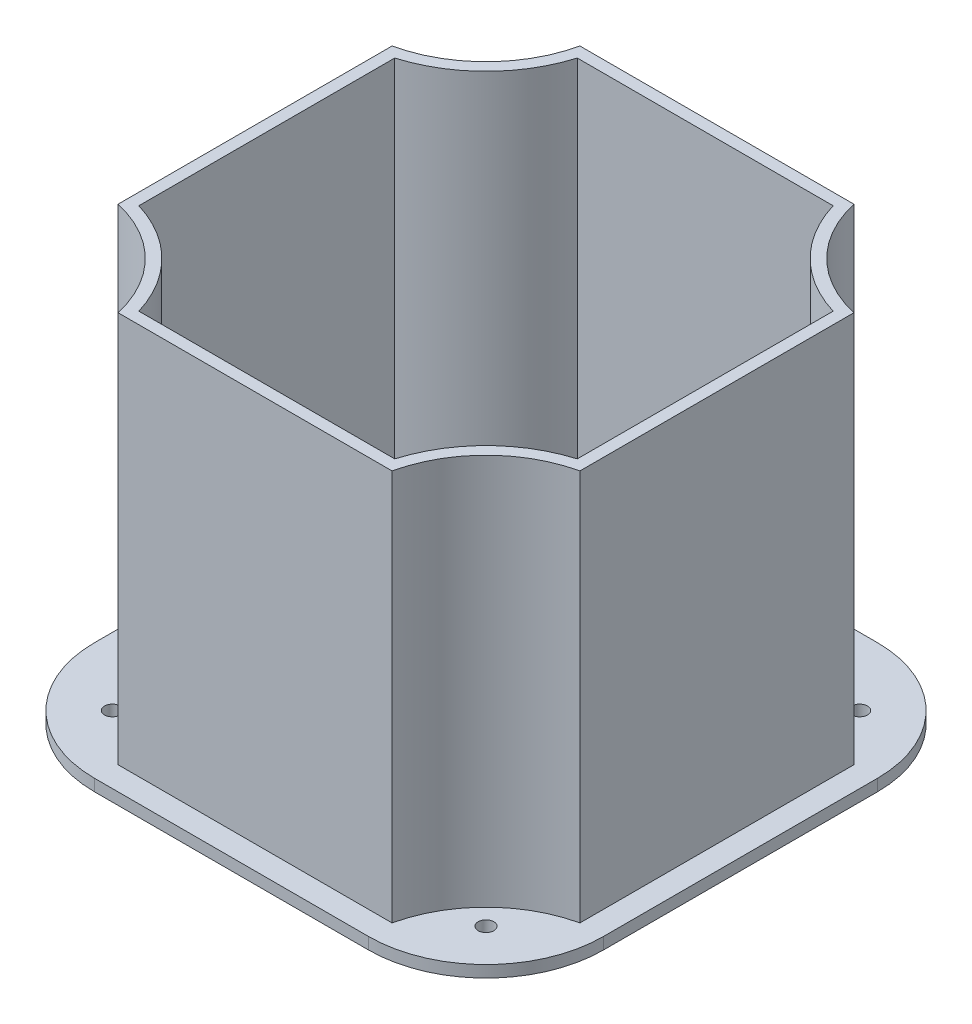
ISO-10303-21;
HEADER;
FILE_DESCRIPTION(('STEP AP214'),'2;1');
FILE_NAME('part.step','',(''),(''),'','','');
FILE_SCHEMA(('AUTOMOTIVE_DESIGN { 1 0 10303 214 1 1 1 1 }'));
ENDSEC;
DATA;
#1=APPLICATION_CONTEXT('core data for automotive mechanical design processes');
#2=APPLICATION_PROTOCOL_DEFINITION('international standard','automotive_design',2000,#1);
#3=PRODUCT_CONTEXT('',#1,'mechanical');
#4=PRODUCT('Part','Part','',(#3));
#5=PRODUCT_RELATED_PRODUCT_CATEGORY('part','',(#4));
#6=PRODUCT_DEFINITION_FORMATION('','',#4);
#7=PRODUCT_DEFINITION_CONTEXT('part definition',#1,'design');
#8=PRODUCT_DEFINITION('design','',#6,#7);
#9=PRODUCT_DEFINITION_SHAPE('','',#8);
#10=(LENGTH_UNIT() NAMED_UNIT(*) SI_UNIT(.MILLI.,.METRE.));
#11=(NAMED_UNIT(*) PLANE_ANGLE_UNIT() SI_UNIT($,.RADIAN.));
#12=(NAMED_UNIT(*) SI_UNIT($,.STERADIAN.) SOLID_ANGLE_UNIT());
#13=UNCERTAINTY_MEASURE_WITH_UNIT(LENGTH_MEASURE(1.E-05),#10,'distance_accuracy_value','');
#14=(GEOMETRIC_REPRESENTATION_CONTEXT(3) GLOBAL_UNCERTAINTY_ASSIGNED_CONTEXT((#13)) GLOBAL_UNIT_ASSIGNED_CONTEXT((#10,
#11,#12)) REPRESENTATION_CONTEXT('',''));
#15=CARTESIAN_POINT('',(0.,0.,0.));
#16=DIRECTION('',(0.,0.,1.));
#17=DIRECTION('',(1.,0.,0.));
#18=AXIS2_PLACEMENT_3D('',#15,#16,#17);
#19=CARTESIAN_POINT('',(18.535245878062,1.5,16.1689695853489));
#20=DIRECTION('',(0.,1.,0.));
#21=DIRECTION('',(0.,0.,1.));
#22=AXIS2_PLACEMENT_3D('',#19,#20,#21);
#23=PLANE('',#22);
#24=CARTESIAN_POINT('',(-22.8287151526167,1.5,-25.1949914453303));
#25=DIRECTION('',(0.,1.,0.));
#26=DIRECTION('',(0.,0.,1.));
#27=AXIS2_PLACEMENT_3D('',#24,#25,#26);
#28=CIRCLE('',#27,1.);
#29=CARTESIAN_POINT('',(-22.8287151526167,1.5,-24.1949914453303));
#30=VERTEX_POINT('',#29);
#31=EDGE_CURVE('E228',#30,#30,#28,.T.);
#32=ORIENTED_EDGE('',*,*,#31,.F.);
#33=EDGE_LOOP('',(#32));
#34=FACE_BOUND('',#33,.T.);
#35=CARTESIAN_POINT('',(24.8992069087408,1.5,22.5329306160279));
#36=DIRECTION('',(0.,1.,0.));
#37=DIRECTION('',(0.,0.,1.));
#38=AXIS2_PLACEMENT_3D('',#35,#36,#37);
#39=CIRCLE('',#38,1.);
#40=CARTESIAN_POINT('',(24.8992069087408,1.5,23.5329306160279));
#41=VERTEX_POINT('',#40);
#42=EDGE_CURVE('E218',#41,#41,#39,.T.);
#43=ORIENTED_EDGE('',*,*,#42,.F.);
#44=EDGE_LOOP('',(#43));
#45=FACE_BOUND('',#44,.T.);
#46=CARTESIAN_POINT('',(18.535245878062,1.5,16.1689695853489));
#47=DIRECTION('',(0.,1.,0.));
#48=DIRECTION('',(0.,0.,1.));
#49=AXIS2_PLACEMENT_3D('',#46,#47,#48);
#50=CIRCLE('',#49,15.);
#51=CARTESIAN_POINT('',(18.5352458780619,1.5,31.1689695853489));
#52=VERTEX_POINT('',#51);
#53=CARTESIAN_POINT('',(33.535245878062,1.5,16.1689695853488));
#54=VERTEX_POINT('',#53);
#55=EDGE_CURVE('E163',#52,#54,#50,.T.);
#56=ORIENTED_EDGE('',*,*,#55,.T.);
#57=DIRECTION('',(0.,0.,-1.));
#58=VECTOR('',#57,1.);
#59=CARTESIAN_POINT('',(33.535245878062,1.5,16.1689695853488));
#60=LINE('',#59,#58);
#61=CARTESIAN_POINT('',(33.535245878062,1.5,-18.831030414651));
#62=VERTEX_POINT('',#61);
#63=EDGE_CURVE('E106',#54,#62,#60,.T.);
#64=ORIENTED_EDGE('',*,*,#63,.T.);
#65=CARTESIAN_POINT('',(18.535245878062,1.5,-18.8310304146511));
#66=DIRECTION('',(0.,1.,0.));
#67=DIRECTION('',(0.,0.,1.));
#68=AXIS2_PLACEMENT_3D('',#65,#66,#67);
#69=CIRCLE('',#68,15.);
#70=CARTESIAN_POINT('',(18.5352458780619,1.5,-33.8310304146511));
#71=VERTEX_POINT('',#70);
#72=EDGE_CURVE('E178',#62,#71,#69,.T.);
#73=ORIENTED_EDGE('',*,*,#72,.T.);
#74=DIRECTION('',(-1.,0.,0.));
#75=VECTOR('',#74,1.);
#76=CARTESIAN_POINT('',(18.5352458780619,1.5,-33.8310304146511));
#77=LINE('',#76,#75);
#78=CARTESIAN_POINT('',(-16.4647541219379,1.5,-33.8310304146511));
#79=VERTEX_POINT('',#78);
#80=EDGE_CURVE('E191',#71,#79,#77,.T.);
#81=ORIENTED_EDGE('',*,*,#80,.T.);
#82=CARTESIAN_POINT('',(-16.464754121938,1.5,-18.8310304146511));
#83=DIRECTION('',(0.,1.,0.));
#84=DIRECTION('',(0.,0.,1.));
#85=AXIS2_PLACEMENT_3D('',#82,#83,#84);
#86=CIRCLE('',#85,15.);
#87=CARTESIAN_POINT('',(-31.464754121938,1.5,-18.831030414651));
#88=VERTEX_POINT('',#87);
#89=EDGE_CURVE('E127',#79,#88,#86,.T.);
#90=ORIENTED_EDGE('',*,*,#89,.T.);
#91=DIRECTION('',(0.,0.,1.));
#92=VECTOR('',#91,1.);
#93=CARTESIAN_POINT('',(-31.464754121938,1.5,-18.831030414651));
#94=LINE('',#93,#92);
#95=CARTESIAN_POINT('',(-31.464754121938,1.5,16.1689695853488));
#96=VERTEX_POINT('',#95);
#97=EDGE_CURVE('E121',#88,#96,#94,.T.);
#98=ORIENTED_EDGE('',*,*,#97,.T.);
#99=CARTESIAN_POINT('',(-16.464754121938,1.5,16.1689695853489));
#100=DIRECTION('',(0.,1.,0.));
#101=DIRECTION('',(0.,0.,1.));
#102=AXIS2_PLACEMENT_3D('',#99,#100,#101);
#103=CIRCLE('',#102,15.);
#104=CARTESIAN_POINT('',(-16.4647541219379,1.5,31.1689695853489));
#105=VERTEX_POINT('',#104);
#106=EDGE_CURVE('E124',#96,#105,#103,.T.);
#107=ORIENTED_EDGE('',*,*,#106,.T.);
#108=DIRECTION('',(1.,0.,0.));
#109=VECTOR('',#108,1.);
#110=CARTESIAN_POINT('',(-16.4647541219379,1.5,31.1689695853489));
#111=LINE('',#110,#109);
#112=EDGE_CURVE('E65',#105,#52,#111,.T.);
#113=ORIENTED_EDGE('',*,*,#112,.T.);
#114=EDGE_LOOP('',(#56,#64,#73,#81,#90,#98,#107,#113));
#115=FACE_BOUND('',#114,.T.);
#116=DIRECTION('',(0.,0.,-1.));
#117=VECTOR('',#116,1.);
#118=CARTESIAN_POINT('',(30.5352458780619,1.5,16.1689695853489));
#119=LINE('',#118,#117);
#120=CARTESIAN_POINT('',(30.5352458780619,1.5,16.1689695853489));
#121=VERTEX_POINT('',#120);
#122=CARTESIAN_POINT('',(30.535245878062,1.5,-18.831030414651));
#123=VERTEX_POINT('',#122);
#124=EDGE_CURVE('E212',#121,#123,#119,.T.);
#125=ORIENTED_EDGE('',*,*,#124,.F.);
#126=CARTESIAN_POINT('',(34.0017247818063,1.5,31.6354484890935));
#127=DIRECTION('',(0.,-1.,0.));
#128=DIRECTION('',(0.,0.,1.));
#129=AXIS2_PLACEMENT_3D('',#126,#127,#128);
#130=CIRCLE('',#129,15.8501875594606);
#131=CARTESIAN_POINT('',(18.5352458780619,1.5,28.1689695853489));
#132=VERTEX_POINT('',#131);
#133=EDGE_CURVE('E215',#132,#121,#130,.T.);
#134=ORIENTED_EDGE('',*,*,#133,.F.);
#135=DIRECTION('',(1.,0.,0.));
#136=VECTOR('',#135,1.);
#137=CARTESIAN_POINT('',(18.5352458780619,1.5,28.1689695853489));
#138=LINE('',#137,#136);
#139=CARTESIAN_POINT('',(-16.4647541219379,1.5,28.1689695853489));
#140=VERTEX_POINT('',#139);
#141=EDGE_CURVE('E56',#140,#132,#138,.T.);
#142=ORIENTED_EDGE('',*,*,#141,.F.);
#143=CARTESIAN_POINT('',(-31.9312330256827,1.5,31.6354484890931));
#144=DIRECTION('',(0.,-1.,0.));
#145=DIRECTION('',(0.,0.,1.));
#146=AXIS2_PLACEMENT_3D('',#143,#144,#145);
#147=CIRCLE('',#146,15.8501875594606);
#148=CARTESIAN_POINT('',(-28.464754121938,1.5,16.1689695853486));
#149=VERTEX_POINT('',#148);
#150=EDGE_CURVE('E198',#149,#140,#147,.T.);
#151=ORIENTED_EDGE('',*,*,#150,.F.);
#152=DIRECTION('',(0.,0.,1.));
#153=VECTOR('',#152,1.);
#154=CARTESIAN_POINT('',(-28.4647541219379,1.5,-18.8310304146514));
#155=LINE('',#154,#153);
#156=CARTESIAN_POINT('',(-28.4647541219379,1.5,-18.8310304146514));
#157=VERTEX_POINT('',#156);
#158=EDGE_CURVE('E200',#157,#149,#155,.T.);
#159=ORIENTED_EDGE('',*,*,#158,.F.);
#160=CARTESIAN_POINT('',(-31.9312330256821,1.5,-34.297509318396));
#161=DIRECTION('',(0.,-1.,0.));
#162=DIRECTION('',(0.,0.,1.));
#163=AXIS2_PLACEMENT_3D('',#160,#161,#162);
#164=CIRCLE('',#163,15.8501875594605);
#165=CARTESIAN_POINT('',(-16.4647541219378,1.5,-30.8310304146511));
#166=VERTEX_POINT('',#165);
#167=EDGE_CURVE('E203',#166,#157,#164,.T.);
#168=ORIENTED_EDGE('',*,*,#167,.F.);
#169=DIRECTION('',(-1.,0.,0.));
#170=VECTOR('',#169,1.);
#171=CARTESIAN_POINT('',(-16.4647541219379,1.5,-30.8310304146511));
#172=LINE('',#171,#170);
#173=CARTESIAN_POINT('',(18.5352458780619,1.5,-30.8310304146511));
#174=VERTEX_POINT('',#173);
#175=EDGE_CURVE('E206',#174,#166,#172,.T.);
#176=ORIENTED_EDGE('',*,*,#175,.F.);
#177=CARTESIAN_POINT('',(34.0017247818065,1.5,-34.2975093183955));
#178=DIRECTION('',(0.,-1.,0.));
#179=DIRECTION('',(0.,0.,1.));
#180=AXIS2_PLACEMENT_3D('',#177,#178,#179);
#181=CIRCLE('',#180,15.8501875594606);
#182=EDGE_CURVE('E209',#123,#174,#181,.T.);
#183=ORIENTED_EDGE('',*,*,#182,.F.);
#184=EDGE_LOOP('',(#125,#134,#142,#151,#159,#168,#176,#183));
#185=FACE_BOUND('',#184,.T.);
#186=CARTESIAN_POINT('',(-22.8287151526171,1.5,22.5329306160277));
#187=DIRECTION('',(0.,1.,0.));
#188=DIRECTION('',(0.,0.,1.));
#189=AXIS2_PLACEMENT_3D('',#186,#187,#188);
#190=CIRCLE('',#189,1.00000000000001);
#191=CARTESIAN_POINT('',(-22.8287151526171,1.5,23.5329306160277));
#192=VERTEX_POINT('',#191);
#193=EDGE_CURVE('E222',#192,#192,#190,.T.);
#194=ORIENTED_EDGE('',*,*,#193,.F.);
#195=EDGE_LOOP('',(#194));
#196=FACE_BOUND('',#195,.T.);
#197=CARTESIAN_POINT('',(24.8992069087409,1.5,-25.1949914453301));
#198=DIRECTION('',(0.,1.,0.));
#199=DIRECTION('',(0.,0.,1.));
#200=AXIS2_PLACEMENT_3D('',#197,#198,#199);
#201=CIRCLE('',#200,1.);
#202=CARTESIAN_POINT('',(24.8992069087409,1.5,-24.1949914453301));
#203=VERTEX_POINT('',#202);
#204=EDGE_CURVE('E234',#203,#203,#201,.T.);
#205=ORIENTED_EDGE('',*,*,#204,.F.);
#206=EDGE_LOOP('',(#205));
#207=FACE_BOUND('',#206,.T.);
#208=ADVANCED_FACE('F41',(#34,#45,#115,#185,#196,#207),#23,.T.);
#209=CARTESIAN_POINT('',(18.535245878062,0.,16.1689695853489));
#210=DIRECTION('',(0.,1.,0.));
#211=DIRECTION('',(0.,0.,1.));
#212=AXIS2_PLACEMENT_3D('',#209,#210,#211);
#213=PLANE('',#212);
#214=CARTESIAN_POINT('',(18.535245878062,0.,16.1689695853489));
#215=DIRECTION('',(0.,1.,0.));
#216=DIRECTION('',(0.,0.,1.));
#217=AXIS2_PLACEMENT_3D('',#214,#215,#216);
#218=CIRCLE('',#217,15.);
#219=CARTESIAN_POINT('',(18.5352458780619,0.,31.1689695853489));
#220=VERTEX_POINT('',#219);
#221=CARTESIAN_POINT('',(33.535245878062,0.,16.1689695853488));
#222=VERTEX_POINT('',#221);
#223=EDGE_CURVE('E148',#220,#222,#218,.T.);
#224=ORIENTED_EDGE('',*,*,#223,.F.);
#225=DIRECTION('',(1.,0.,0.));
#226=VECTOR('',#225,1.);
#227=CARTESIAN_POINT('',(-16.4647541219379,0.,31.1689695853489));
#228=LINE('',#227,#226);
#229=CARTESIAN_POINT('',(-16.4647541219379,0.,31.1689695853489));
#230=VERTEX_POINT('',#229);
#231=EDGE_CURVE('E98',#230,#220,#228,.T.);
#232=ORIENTED_EDGE('',*,*,#231,.F.);
#233=CARTESIAN_POINT('',(-16.464754121938,0.,16.1689695853489));
#234=DIRECTION('',(0.,1.,0.));
#235=DIRECTION('',(0.,0.,1.));
#236=AXIS2_PLACEMENT_3D('',#233,#234,#235);
#237=CIRCLE('',#236,15.);
#238=CARTESIAN_POINT('',(-31.464754121938,0.,16.1689695853488));
#239=VERTEX_POINT('',#238);
#240=EDGE_CURVE('E160',#239,#230,#237,.T.);
#241=ORIENTED_EDGE('',*,*,#240,.F.);
#242=DIRECTION('',(0.,0.,1.));
#243=VECTOR('',#242,1.);
#244=CARTESIAN_POINT('',(-31.464754121938,0.,-18.831030414651));
#245=LINE('',#244,#243);
#246=CARTESIAN_POINT('',(-31.464754121938,0.,-18.831030414651));
#247=VERTEX_POINT('',#246);
#248=EDGE_CURVE('E136',#247,#239,#245,.T.);
#249=ORIENTED_EDGE('',*,*,#248,.F.);
#250=CARTESIAN_POINT('',(-16.464754121938,0.,-18.8310304146511));
#251=DIRECTION('',(0.,1.,0.));
#252=DIRECTION('',(0.,0.,1.));
#253=AXIS2_PLACEMENT_3D('',#250,#251,#252);
#254=CIRCLE('',#253,15.);
#255=CARTESIAN_POINT('',(-16.4647541219379,0.,-33.8310304146511));
#256=VERTEX_POINT('',#255);
#257=EDGE_CURVE('E157',#256,#247,#254,.T.);
#258=ORIENTED_EDGE('',*,*,#257,.F.);
#259=DIRECTION('',(-1.,0.,0.));
#260=VECTOR('',#259,1.);
#261=CARTESIAN_POINT('',(18.5352458780619,0.,-33.8310304146511));
#262=LINE('',#261,#260);
#263=CARTESIAN_POINT('',(18.5352458780619,0.,-33.8310304146511));
#264=VERTEX_POINT('',#263);
#265=EDGE_CURVE('E155',#264,#256,#262,.T.);
#266=ORIENTED_EDGE('',*,*,#265,.F.);
#267=CARTESIAN_POINT('',(18.535245878062,0.,-18.8310304146511));
#268=DIRECTION('',(0.,1.,0.));
#269=DIRECTION('',(0.,0.,1.));
#270=AXIS2_PLACEMENT_3D('',#267,#268,#269);
#271=CIRCLE('',#270,15.);
#272=CARTESIAN_POINT('',(33.535245878062,0.,-18.831030414651));
#273=VERTEX_POINT('',#272);
#274=EDGE_CURVE('E153',#273,#264,#271,.T.);
#275=ORIENTED_EDGE('',*,*,#274,.F.);
#276=DIRECTION('',(0.,0.,-1.));
#277=VECTOR('',#276,1.);
#278=CARTESIAN_POINT('',(33.535245878062,0.,16.1689695853488));
#279=LINE('',#278,#277);
#280=EDGE_CURVE('E151',#222,#273,#279,.T.);
#281=ORIENTED_EDGE('',*,*,#280,.F.);
#282=EDGE_LOOP('',(#224,#232,#241,#249,#258,#266,#275,#281));
#283=FACE_BOUND('',#282,.T.);
#284=CARTESIAN_POINT('',(24.8992069087408,0.,22.5329306160279));
#285=DIRECTION('',(0.,1.,0.));
#286=DIRECTION('',(0.,0.,1.));
#287=AXIS2_PLACEMENT_3D('',#284,#285,#286);
#288=CIRCLE('',#287,1.);
#289=CARTESIAN_POINT('',(24.8992069087408,0.,23.5329306160279));
#290=VERTEX_POINT('',#289);
#291=EDGE_CURVE('E219',#290,#290,#288,.T.);
#292=ORIENTED_EDGE('',*,*,#291,.T.);
#293=EDGE_LOOP('',(#292));
#294=FACE_BOUND('',#293,.T.);
#295=CARTESIAN_POINT('',(-22.8287151526171,0.,22.5329306160277));
#296=DIRECTION('',(0.,1.,0.));
#297=DIRECTION('',(0.,0.,1.));
#298=AXIS2_PLACEMENT_3D('',#295,#296,#297);
#299=CIRCLE('',#298,1.00000000000001);
#300=CARTESIAN_POINT('',(-22.8287151526171,0.,23.5329306160277));
#301=VERTEX_POINT('',#300);
#302=EDGE_CURVE('E225',#301,#301,#299,.T.);
#303=ORIENTED_EDGE('',*,*,#302,.T.);
#304=EDGE_LOOP('',(#303));
#305=FACE_BOUND('',#304,.T.);
#306=CARTESIAN_POINT('',(-22.8287151526167,0.,-25.1949914453303));
#307=DIRECTION('',(0.,1.,0.));
#308=DIRECTION('',(0.,0.,1.));
#309=AXIS2_PLACEMENT_3D('',#306,#307,#308);
#310=CIRCLE('',#309,1.);
#311=CARTESIAN_POINT('',(-22.8287151526167,0.,-24.1949914453303));
#312=VERTEX_POINT('',#311);
#313=EDGE_CURVE('E231',#312,#312,#310,.T.);
#314=ORIENTED_EDGE('',*,*,#313,.T.);
#315=EDGE_LOOP('',(#314));
#316=FACE_BOUND('',#315,.T.);
#317=CARTESIAN_POINT('',(24.8992069087409,0.,-25.1949914453301));
#318=DIRECTION('',(0.,1.,0.));
#319=DIRECTION('',(0.,0.,1.));
#320=AXIS2_PLACEMENT_3D('',#317,#318,#319);
#321=CIRCLE('',#320,1.);
#322=CARTESIAN_POINT('',(24.8992069087409,0.,-24.1949914453301));
#323=VERTEX_POINT('',#322);
#324=EDGE_CURVE('E237',#323,#323,#321,.T.);
#325=ORIENTED_EDGE('',*,*,#324,.T.);
#326=EDGE_LOOP('',(#325));
#327=FACE_BOUND('',#326,.T.);
#328=DIRECTION('',(0.,0.,1.));
#329=VECTOR('',#328,1.);
#330=CARTESIAN_POINT('',(29.0352458780619,0.,15.0112764601735));
#331=LINE('',#330,#329);
#332=CARTESIAN_POINT('',(29.035245878062,0.,-17.6733372894756));
#333=VERTEX_POINT('',#332);
#334=CARTESIAN_POINT('',(29.0352458780619,0.,15.0112764601735));
#335=VERTEX_POINT('',#334);
#336=EDGE_CURVE('E339',#333,#335,#331,.T.);
#337=ORIENTED_EDGE('',*,*,#336,.F.);
#338=CARTESIAN_POINT('',(34.0017247818065,0.,-34.2975093183955));
#339=DIRECTION('',(0.,1.,0.));
#340=DIRECTION('',(0.,0.,1.));
#341=AXIS2_PLACEMENT_3D('',#338,#339,#340);
#342=CIRCLE('',#341,17.3501875594607);
#343=CARTESIAN_POINT('',(17.3775527528865,0.,-29.3310304146511));
#344=VERTEX_POINT('',#343);
#345=EDGE_CURVE('E338',#344,#333,#342,.T.);
#346=ORIENTED_EDGE('',*,*,#345,.F.);
#347=DIRECTION('',(1.,0.,0.));
#348=VECTOR('',#347,1.);
#349=CARTESIAN_POINT('',(17.3775527528865,0.,-29.3310304146511));
#350=LINE('',#349,#348);
#351=CARTESIAN_POINT('',(-15.3070609967623,0.,-29.3310304146511));
#352=VERTEX_POINT('',#351);
#353=EDGE_CURVE('E357',#352,#344,#350,.T.);
#354=ORIENTED_EDGE('',*,*,#353,.F.);
#355=CARTESIAN_POINT('',(-31.9312330256821,0.,-34.297509318396));
#356=DIRECTION('',(0.,1.,0.));
#357=DIRECTION('',(0.,0.,1.));
#358=AXIS2_PLACEMENT_3D('',#355,#356,#357);
#359=CIRCLE('',#358,17.3501875594606);
#360=CARTESIAN_POINT('',(-26.9647541219379,0.,-17.673337289476));
#361=VERTEX_POINT('',#360);
#362=EDGE_CURVE('E354',#361,#352,#359,.T.);
#363=ORIENTED_EDGE('',*,*,#362,.F.);
#364=DIRECTION('',(0.,0.,-1.));
#365=VECTOR('',#364,1.);
#366=CARTESIAN_POINT('',(-26.9647541219379,0.,-17.673337289476));
#367=LINE('',#366,#365);
#368=CARTESIAN_POINT('',(-26.964754121938,0.,15.0112764601731));
#369=VERTEX_POINT('',#368);
#370=EDGE_CURVE('E351',#369,#361,#367,.T.);
#371=ORIENTED_EDGE('',*,*,#370,.F.);
#372=CARTESIAN_POINT('',(-31.9312330256827,0.,31.6354484890931));
#373=DIRECTION('',(0.,1.,0.));
#374=DIRECTION('',(0.,0.,1.));
#375=AXIS2_PLACEMENT_3D('',#372,#373,#374);
#376=CIRCLE('',#375,17.3501875594608);
#377=CARTESIAN_POINT('',(-15.3070609967626,0.,26.6689695853489));
#378=VERTEX_POINT('',#377);
#379=EDGE_CURVE('E348',#378,#369,#376,.T.);
#380=ORIENTED_EDGE('',*,*,#379,.F.);
#381=DIRECTION('',(-1.,0.,0.));
#382=VECTOR('',#381,1.);
#383=CARTESIAN_POINT('',(-15.3070609967626,0.,26.6689695853489));
#384=LINE('',#383,#382);
#385=CARTESIAN_POINT('',(17.3775527528864,0.,26.6689695853489));
#386=VERTEX_POINT('',#385);
#387=EDGE_CURVE('E345',#386,#378,#384,.T.);
#388=ORIENTED_EDGE('',*,*,#387,.F.);
#389=CARTESIAN_POINT('',(34.0017247818063,0.,31.6354484890935));
#390=DIRECTION('',(0.,1.,0.));
#391=DIRECTION('',(0.,0.,1.));
#392=AXIS2_PLACEMENT_3D('',#389,#390,#391);
#393=CIRCLE('',#392,17.3501875594606);
#394=EDGE_CURVE('E342',#335,#386,#393,.T.);
#395=ORIENTED_EDGE('',*,*,#394,.F.);
#396=EDGE_LOOP('',(#337,#346,#354,#363,#371,#380,#388,#395));
#397=FACE_BOUND('',#396,.T.);
#398=ADVANCED_FACE('F182',(#283,#294,#305,#316,#327,#397),#213,.F.);
#399=CARTESIAN_POINT('',(18.535245878062,1.5,16.1689695853489));
#400=DIRECTION('',(0.,-1.,0.));
#401=DIRECTION('',(0.,0.,-1.));
#402=AXIS2_PLACEMENT_3D('',#399,#400,#401);
#403=CYLINDRICAL_SURFACE('',#402,15.);
#404=ORIENTED_EDGE('',*,*,#223,.T.);
#405=DIRECTION('',(0.,-1.,0.));
#406=VECTOR('',#405,1.);
#407=CARTESIAN_POINT('',(33.535245878062,1.5,16.1689695853488));
#408=LINE('',#407,#406);
#409=EDGE_CURVE('E11',#54,#222,#408,.T.);
#410=ORIENTED_EDGE('',*,*,#409,.F.);
#411=ORIENTED_EDGE('',*,*,#55,.F.);
#412=DIRECTION('',(0.,-1.,0.));
#413=VECTOR('',#412,1.);
#414=CARTESIAN_POINT('',(18.5352458780619,1.5,31.1689695853489));
#415=LINE('',#414,#413);
#416=EDGE_CURVE('E144',#52,#220,#415,.T.);
#417=ORIENTED_EDGE('',*,*,#416,.T.);
#418=EDGE_LOOP('',(#404,#410,#411,#417));
#419=FACE_BOUND('',#418,.T.);
#420=ADVANCED_FACE('F43',(#419),#403,.T.);
#421=CARTESIAN_POINT('',(33.535245878062,1.5,16.1689695853488));
#422=DIRECTION('',(-1.,0.,0.));
#423=DIRECTION('',(0.,0.,1.));
#424=AXIS2_PLACEMENT_3D('',#421,#422,#423);
#425=PLANE('',#424);
#426=ORIENTED_EDGE('',*,*,#280,.T.);
#427=DIRECTION('',(0.,-1.,0.));
#428=VECTOR('',#427,1.);
#429=CARTESIAN_POINT('',(33.535245878062,1.5,-18.831030414651));
#430=LINE('',#429,#428);
#431=EDGE_CURVE('E49',#62,#273,#430,.T.);
#432=ORIENTED_EDGE('',*,*,#431,.F.);
#433=ORIENTED_EDGE('',*,*,#63,.F.);
#434=ORIENTED_EDGE('',*,*,#409,.T.);
#435=EDGE_LOOP('',(#426,#432,#433,#434));
#436=FACE_BOUND('',#435,.T.);
#437=ADVANCED_FACE('F533',(#436),#425,.F.);
#438=CARTESIAN_POINT('',(18.535245878062,1.5,-18.8310304146511));
#439=DIRECTION('',(0.,-1.,0.));
#440=DIRECTION('',(0.,0.,-1.));
#441=AXIS2_PLACEMENT_3D('',#438,#439,#440);
#442=CYLINDRICAL_SURFACE('',#441,15.);
#443=ORIENTED_EDGE('',*,*,#274,.T.);
#444=DIRECTION('',(0.,-1.,0.));
#445=VECTOR('',#444,1.);
#446=CARTESIAN_POINT('',(18.5352458780619,1.5,-33.8310304146511));
#447=LINE('',#446,#445);
#448=EDGE_CURVE('E170',#71,#264,#447,.T.);
#449=ORIENTED_EDGE('',*,*,#448,.F.);
#450=ORIENTED_EDGE('',*,*,#72,.F.);
#451=ORIENTED_EDGE('',*,*,#431,.T.);
#452=EDGE_LOOP('',(#443,#449,#450,#451));
#453=FACE_BOUND('',#452,.T.);
#454=ADVANCED_FACE('F176',(#453),#442,.T.);
#455=CARTESIAN_POINT('',(18.5352458780619,1.5,-33.8310304146511));
#456=DIRECTION('',(0.,0.,1.));
#457=DIRECTION('',(1.,0.,0.));
#458=AXIS2_PLACEMENT_3D('',#455,#456,#457);
#459=PLANE('',#458);
#460=ORIENTED_EDGE('',*,*,#265,.T.);
#461=DIRECTION('',(0.,-1.,0.));
#462=VECTOR('',#461,1.);
#463=CARTESIAN_POINT('',(-16.4647541219379,1.5,-33.8310304146511));
#464=LINE('',#463,#462);
#465=EDGE_CURVE('E167',#79,#256,#464,.T.);
#466=ORIENTED_EDGE('',*,*,#465,.F.);
#467=ORIENTED_EDGE('',*,*,#80,.F.);
#468=ORIENTED_EDGE('',*,*,#448,.T.);
#469=EDGE_LOOP('',(#460,#466,#467,#468));
#470=FACE_BOUND('',#469,.T.);
#471=ADVANCED_FACE('F187',(#470),#459,.F.);
#472=CARTESIAN_POINT('',(-16.464754121938,1.5,-18.8310304146511));
#473=DIRECTION('',(0.,-1.,0.));
#474=DIRECTION('',(0.,0.,-1.));
#475=AXIS2_PLACEMENT_3D('',#472,#473,#474);
#476=CYLINDRICAL_SURFACE('',#475,15.);
#477=ORIENTED_EDGE('',*,*,#257,.T.);
#478=DIRECTION('',(0.,-1.,0.));
#479=VECTOR('',#478,1.);
#480=CARTESIAN_POINT('',(-31.464754121938,1.5,-18.831030414651));
#481=LINE('',#480,#479);
#482=EDGE_CURVE('E139',#88,#247,#481,.T.);
#483=ORIENTED_EDGE('',*,*,#482,.F.);
#484=ORIENTED_EDGE('',*,*,#89,.F.);
#485=ORIENTED_EDGE('',*,*,#465,.T.);
#486=EDGE_LOOP('',(#477,#483,#484,#485));
#487=FACE_BOUND('',#486,.T.);
#488=ADVANCED_FACE('F190',(#487),#476,.T.);
#489=CARTESIAN_POINT('',(-31.464754121938,1.5,-18.831030414651));
#490=DIRECTION('',(1.,0.,0.));
#491=DIRECTION('',(0.,0.,-1.));
#492=AXIS2_PLACEMENT_3D('',#489,#490,#491);
#493=PLANE('',#492);
#494=ORIENTED_EDGE('',*,*,#248,.T.);
#495=DIRECTION('',(0.,-1.,0.));
#496=VECTOR('',#495,1.);
#497=CARTESIAN_POINT('',(-31.464754121938,1.5,16.1689695853488));
#498=LINE('',#497,#496);
#499=EDGE_CURVE('E133',#96,#239,#498,.T.);
#500=ORIENTED_EDGE('',*,*,#499,.F.);
#501=ORIENTED_EDGE('',*,*,#97,.F.);
#502=ORIENTED_EDGE('',*,*,#482,.T.);
#503=EDGE_LOOP('',(#494,#500,#501,#502));
#504=FACE_BOUND('',#503,.T.);
#505=ADVANCED_FACE('F134',(#504),#493,.F.);
#506=CARTESIAN_POINT('',(-16.464754121938,1.5,16.1689695853489));
#507=DIRECTION('',(0.,-1.,0.));
#508=DIRECTION('',(0.,0.,-1.));
#509=AXIS2_PLACEMENT_3D('',#506,#507,#508);
#510=CYLINDRICAL_SURFACE('',#509,15.);
#511=ORIENTED_EDGE('',*,*,#240,.T.);
#512=DIRECTION('',(0.,-1.,0.));
#513=VECTOR('',#512,1.);
#514=CARTESIAN_POINT('',(-16.4647541219379,1.5,31.1689695853489));
#515=LINE('',#514,#513);
#516=EDGE_CURVE('E140',#105,#230,#515,.T.);
#517=ORIENTED_EDGE('',*,*,#516,.F.);
#518=ORIENTED_EDGE('',*,*,#106,.F.);
#519=ORIENTED_EDGE('',*,*,#499,.T.);
#520=EDGE_LOOP('',(#511,#517,#518,#519));
#521=FACE_BOUND('',#520,.T.);
#522=ADVANCED_FACE('F142',(#521),#510,.T.);
#523=CARTESIAN_POINT('',(-16.4647541219379,1.5,31.1689695853489));
#524=DIRECTION('',(0.,0.,-1.));
#525=DIRECTION('',(-1.,0.,0.));
#526=AXIS2_PLACEMENT_3D('',#523,#524,#525);
#527=PLANE('',#526);
#528=ORIENTED_EDGE('',*,*,#231,.T.);
#529=ORIENTED_EDGE('',*,*,#416,.F.);
#530=ORIENTED_EDGE('',*,*,#112,.F.);
#531=ORIENTED_EDGE('',*,*,#516,.T.);
#532=EDGE_LOOP('',(#528,#529,#530,#531));
#533=FACE_BOUND('',#532,.T.);
#534=ADVANCED_FACE('F521',(#533),#527,.F.);
#535=CARTESIAN_POINT('',(24.8992069087408,1.5,22.5329306160279));
#536=DIRECTION('',(0.,-1.,0.));
#537=DIRECTION('',(0.,0.,-1.));
#538=AXIS2_PLACEMENT_3D('',#535,#536,#537);
#539=CYLINDRICAL_SURFACE('',#538,1.);
#540=ORIENTED_EDGE('',*,*,#42,.T.);
#541=EDGE_LOOP('',(#540));
#542=FACE_BOUND('',#541,.T.);
#543=ORIENTED_EDGE('',*,*,#291,.F.);
#544=EDGE_LOOP('',(#543));
#545=FACE_BOUND('',#544,.T.);
#546=ADVANCED_FACE('F518',(#542,#545),#539,.F.);
#547=CARTESIAN_POINT('',(-22.8287151526171,1.5,22.5329306160277));
#548=DIRECTION('',(0.,-1.,0.));
#549=DIRECTION('',(0.,0.,-1.));
#550=AXIS2_PLACEMENT_3D('',#547,#548,#549);
#551=CYLINDRICAL_SURFACE('',#550,1.00000000000001);
#552=ORIENTED_EDGE('',*,*,#193,.T.);
#553=EDGE_LOOP('',(#552));
#554=FACE_BOUND('',#553,.T.);
#555=ORIENTED_EDGE('',*,*,#302,.F.);
#556=EDGE_LOOP('',(#555));
#557=FACE_BOUND('',#556,.T.);
#558=ADVANCED_FACE('F578',(#554,#557),#551,.F.);
#559=CARTESIAN_POINT('',(-22.8287151526167,1.5,-25.1949914453303));
#560=DIRECTION('',(0.,-1.,0.));
#561=DIRECTION('',(0.,0.,-1.));
#562=AXIS2_PLACEMENT_3D('',#559,#560,#561);
#563=CYLINDRICAL_SURFACE('',#562,1.);
#564=ORIENTED_EDGE('',*,*,#31,.T.);
#565=EDGE_LOOP('',(#564));
#566=FACE_BOUND('',#565,.T.);
#567=ORIENTED_EDGE('',*,*,#313,.F.);
#568=EDGE_LOOP('',(#567));
#569=FACE_BOUND('',#568,.T.);
#570=ADVANCED_FACE('F566',(#566,#569),#563,.F.);
#571=CARTESIAN_POINT('',(24.8992069087409,1.5,-25.1949914453301));
#572=DIRECTION('',(0.,-1.,0.));
#573=DIRECTION('',(0.,0.,-1.));
#574=AXIS2_PLACEMENT_3D('',#571,#572,#573);
#575=CYLINDRICAL_SURFACE('',#574,1.);
#576=ORIENTED_EDGE('',*,*,#204,.T.);
#577=EDGE_LOOP('',(#576));
#578=FACE_BOUND('',#577,.T.);
#579=ORIENTED_EDGE('',*,*,#324,.F.);
#580=EDGE_LOOP('',(#579));
#581=FACE_BOUND('',#580,.T.);
#582=ADVANCED_FACE('F560',(#578,#581),#575,.F.);
#583=CARTESIAN_POINT('',(-31.9312330256821,51.5,-34.297509318396));
#584=DIRECTION('',(0.,1.,0.));
#585=DIRECTION('',(0.,0.,1.));
#586=AXIS2_PLACEMENT_3D('',#583,#584,#585);
#587=PLANE('',#586);
#588=CARTESIAN_POINT('',(-31.9312330256821,51.5,-34.297509318396));
#589=DIRECTION('',(0.,-1.,0.));
#590=DIRECTION('',(0.,0.,1.));
#591=AXIS2_PLACEMENT_3D('',#588,#589,#590);
#592=CIRCLE('',#591,15.8501875594606);
#593=CARTESIAN_POINT('',(-16.4647541219378,51.5,-30.8310304146511));
#594=VERTEX_POINT('',#593);
#595=CARTESIAN_POINT('',(-28.4647541219379,51.5,-18.8310304146514));
#596=VERTEX_POINT('',#595);
#597=EDGE_CURVE('E287',#594,#596,#592,.T.);
#598=ORIENTED_EDGE('',*,*,#597,.T.);
#599=DIRECTION('',(0.,0.,1.));
#600=VECTOR('',#599,1.);
#601=CARTESIAN_POINT('',(-28.4647541219379,51.5,-18.8310304146514));
#602=LINE('',#601,#600);
#603=CARTESIAN_POINT('',(-28.464754121938,51.5,16.1689695853486));
#604=VERTEX_POINT('',#603);
#605=EDGE_CURVE('E284',#596,#604,#602,.T.);
#606=ORIENTED_EDGE('',*,*,#605,.T.);
#607=CARTESIAN_POINT('',(-31.9312330256827,51.5,31.6354484890931));
#608=DIRECTION('',(0.,-1.,0.));
#609=DIRECTION('',(0.,0.,1.));
#610=AXIS2_PLACEMENT_3D('',#607,#608,#609);
#611=CIRCLE('',#610,15.8501875594607);
#612=CARTESIAN_POINT('',(-16.464754121938,51.5,28.1689695853489));
#613=VERTEX_POINT('',#612);
#614=EDGE_CURVE('E281',#604,#613,#611,.T.);
#615=ORIENTED_EDGE('',*,*,#614,.T.);
#616=DIRECTION('',(1.,0.,0.));
#617=VECTOR('',#616,1.);
#618=CARTESIAN_POINT('',(-16.4647541219379,51.5,28.1689695853489));
#619=LINE('',#618,#617);
#620=CARTESIAN_POINT('',(18.5352458780619,51.5,28.1689695853489));
#621=VERTEX_POINT('',#620);
#622=EDGE_CURVE('E278',#613,#621,#619,.T.);
#623=ORIENTED_EDGE('',*,*,#622,.T.);
#624=CARTESIAN_POINT('',(34.0017247818063,51.5,31.6354484890935));
#625=DIRECTION('',(0.,-1.,0.));
#626=DIRECTION('',(0.,0.,1.));
#627=AXIS2_PLACEMENT_3D('',#624,#625,#626);
#628=CIRCLE('',#627,15.8501875594606);
#629=CARTESIAN_POINT('',(30.5352458780619,51.5,16.168969585349));
#630=VERTEX_POINT('',#629);
#631=EDGE_CURVE('E275',#621,#630,#628,.T.);
#632=ORIENTED_EDGE('',*,*,#631,.T.);
#633=DIRECTION('',(0.,0.,-1.));
#634=VECTOR('',#633,1.);
#635=CARTESIAN_POINT('',(30.5352458780619,51.5,16.1689695853489));
#636=LINE('',#635,#634);
#637=CARTESIAN_POINT('',(30.535245878062,51.5,-18.831030414651));
#638=VERTEX_POINT('',#637);
#639=EDGE_CURVE('E272',#630,#638,#636,.T.);
#640=ORIENTED_EDGE('',*,*,#639,.T.);
#641=CARTESIAN_POINT('',(34.0017247818065,51.5,-34.2975093183955));
#642=DIRECTION('',(0.,-1.,0.));
#643=DIRECTION('',(0.,0.,1.));
#644=AXIS2_PLACEMENT_3D('',#641,#642,#643);
#645=CIRCLE('',#644,15.8501875594607);
#646=CARTESIAN_POINT('',(18.5352458780619,51.5,-30.8310304146511));
#647=VERTEX_POINT('',#646);
#648=EDGE_CURVE('E269',#638,#647,#645,.T.);
#649=ORIENTED_EDGE('',*,*,#648,.T.);
#650=DIRECTION('',(-1.,0.,0.));
#651=VECTOR('',#650,1.);
#652=CARTESIAN_POINT('',(18.5352458780619,51.5,-30.8310304146511));
#653=LINE('',#652,#651);
#654=EDGE_CURVE('E266',#647,#594,#653,.T.);
#655=ORIENTED_EDGE('',*,*,#654,.T.);
#656=EDGE_LOOP('',(#598,#606,#615,#623,#632,#640,#649,#655));
#657=FACE_BOUND('',#656,.T.);
#658=DIRECTION('',(0.,0.,-1.));
#659=VECTOR('',#658,1.);
#660=CARTESIAN_POINT('',(29.0352458780619,51.5,15.0112764601735));
#661=LINE('',#660,#659);
#662=CARTESIAN_POINT('',(29.0352458780619,51.5,15.0112764601735));
#663=VERTEX_POINT('',#662);
#664=CARTESIAN_POINT('',(29.035245878062,51.5,-17.6733372894756));
#665=VERTEX_POINT('',#664);
#666=EDGE_CURVE('E332',#663,#665,#661,.T.);
#667=ORIENTED_EDGE('',*,*,#666,.F.);
#668=CARTESIAN_POINT('',(34.0017247818063,51.5,31.6354484890935));
#669=DIRECTION('',(0.,-1.,0.));
#670=DIRECTION('',(0.,0.,1.));
#671=AXIS2_PLACEMENT_3D('',#668,#669,#670);
#672=CIRCLE('',#671,17.3501875594606);
#673=CARTESIAN_POINT('',(17.3775527528864,51.5,26.6689695853489));
#674=VERTEX_POINT('',#673);
#675=EDGE_CURVE('E335',#674,#663,#672,.T.);
#676=ORIENTED_EDGE('',*,*,#675,.F.);
#677=DIRECTION('',(1.,0.,0.));
#678=VECTOR('',#677,1.);
#679=CARTESIAN_POINT('',(-15.3070609967626,51.5,26.6689695853489));
#680=LINE('',#679,#678);
#681=CARTESIAN_POINT('',(-15.3070609967626,51.5,26.6689695853489));
#682=VERTEX_POINT('',#681);
#683=EDGE_CURVE('E314',#682,#674,#680,.T.);
#684=ORIENTED_EDGE('',*,*,#683,.F.);
#685=CARTESIAN_POINT('',(-31.9312330256827,51.5,31.6354484890931));
#686=DIRECTION('',(0.,-1.,0.));
#687=DIRECTION('',(0.,0.,1.));
#688=AXIS2_PLACEMENT_3D('',#685,#686,#687);
#689=CIRCLE('',#688,17.3501875594608);
#690=CARTESIAN_POINT('',(-26.964754121938,51.5,15.0112764601731));
#691=VERTEX_POINT('',#690);
#692=EDGE_CURVE('E317',#691,#682,#689,.T.);
#693=ORIENTED_EDGE('',*,*,#692,.F.);
#694=DIRECTION('',(0.,0.,1.));
#695=VECTOR('',#694,1.);
#696=CARTESIAN_POINT('',(-26.9647541219379,51.5,-17.673337289476));
#697=LINE('',#696,#695);
#698=CARTESIAN_POINT('',(-26.9647541219379,51.5,-17.673337289476));
#699=VERTEX_POINT('',#698);
#700=EDGE_CURVE('E320',#699,#691,#697,.T.);
#701=ORIENTED_EDGE('',*,*,#700,.F.);
#702=CARTESIAN_POINT('',(-31.9312330256821,51.5,-34.297509318396));
#703=DIRECTION('',(0.,-1.,0.));
#704=DIRECTION('',(0.,0.,1.));
#705=AXIS2_PLACEMENT_3D('',#702,#703,#704);
#706=CIRCLE('',#705,17.3501875594606);
#707=CARTESIAN_POINT('',(-15.3070609967623,51.5,-29.3310304146511));
#708=VERTEX_POINT('',#707);
#709=EDGE_CURVE('E323',#708,#699,#706,.T.);
#710=ORIENTED_EDGE('',*,*,#709,.F.);
#711=DIRECTION('',(-1.,0.,0.));
#712=VECTOR('',#711,1.);
#713=CARTESIAN_POINT('',(17.3775527528865,51.5,-29.3310304146511));
#714=LINE('',#713,#712);
#715=CARTESIAN_POINT('',(17.3775527528865,51.5,-29.3310304146511));
#716=VERTEX_POINT('',#715);
#717=EDGE_CURVE('E326',#716,#708,#714,.T.);
#718=ORIENTED_EDGE('',*,*,#717,.F.);
#719=CARTESIAN_POINT('',(34.0017247818065,51.5,-34.2975093183955));
#720=DIRECTION('',(0.,-1.,0.));
#721=DIRECTION('',(0.,0.,1.));
#722=AXIS2_PLACEMENT_3D('',#719,#720,#721);
#723=CIRCLE('',#722,17.3501875594607);
#724=EDGE_CURVE('E329',#665,#716,#723,.T.);
#725=ORIENTED_EDGE('',*,*,#724,.F.);
#726=EDGE_LOOP('',(#667,#676,#684,#693,#701,#710,#718,#725));
#727=FACE_BOUND('',#726,.T.);
#728=ADVANCED_FACE('F396',(#657,#727),#587,.T.);
#729=CARTESIAN_POINT('',(-31.9312330256821,51.5,-34.297509318396));
#730=DIRECTION('',(0.,-1.,0.));
#731=DIRECTION('',(0.,0.,-1.));
#732=AXIS2_PLACEMENT_3D('',#729,#730,#731);
#733=CYLINDRICAL_SURFACE('',#732,15.8501875594606);
#734=ORIENTED_EDGE('',*,*,#167,.T.);
#735=DIRECTION('',(0.,-1.,0.));
#736=VECTOR('',#735,1.);
#737=CARTESIAN_POINT('',(-28.4647541219379,51.5,-18.8310304146514));
#738=LINE('',#737,#736);
#739=EDGE_CURVE('E240',#596,#157,#738,.T.);
#740=ORIENTED_EDGE('',*,*,#739,.F.);
#741=ORIENTED_EDGE('',*,*,#597,.F.);
#742=DIRECTION('',(0.,-1.,0.));
#743=VECTOR('',#742,1.);
#744=CARTESIAN_POINT('',(-16.4647541219378,51.5,-30.8310304146511));
#745=LINE('',#744,#743);
#746=EDGE_CURVE('E263',#594,#166,#745,.T.);
#747=ORIENTED_EDGE('',*,*,#746,.T.);
#748=EDGE_LOOP('',(#734,#740,#741,#747));
#749=FACE_BOUND('',#748,.T.);
#750=ADVANCED_FACE('F488',(#749),#733,.F.);
#751=CARTESIAN_POINT('',(-28.4647541219379,51.5,-18.8310304146514));
#752=DIRECTION('',(1.,0.,0.));
#753=DIRECTION('',(0.,0.,-1.));
#754=AXIS2_PLACEMENT_3D('',#751,#752,#753);
#755=PLANE('',#754);
#756=ORIENTED_EDGE('',*,*,#158,.T.);
#757=DIRECTION('',(0.,-1.,0.));
#758=VECTOR('',#757,1.);
#759=CARTESIAN_POINT('',(-28.464754121938,51.5,16.1689695853486));
#760=LINE('',#759,#758);
#761=EDGE_CURVE('E245',#604,#149,#760,.T.);
#762=ORIENTED_EDGE('',*,*,#761,.F.);
#763=ORIENTED_EDGE('',*,*,#605,.F.);
#764=ORIENTED_EDGE('',*,*,#739,.T.);
#765=EDGE_LOOP('',(#756,#762,#763,#764));
#766=FACE_BOUND('',#765,.T.);
#767=ADVANCED_FACE('F485',(#766),#755,.F.);
#768=CARTESIAN_POINT('',(-31.9312330256827,51.5,31.6354484890931));
#769=DIRECTION('',(0.,-1.,0.));
#770=DIRECTION('',(0.,0.,-1.));
#771=AXIS2_PLACEMENT_3D('',#768,#769,#770);
#772=CYLINDRICAL_SURFACE('',#771,15.8501875594607);
#773=ORIENTED_EDGE('',*,*,#150,.T.);
#774=DIRECTION('',(0.,-1.,0.));
#775=VECTOR('',#774,1.);
#776=CARTESIAN_POINT('',(-16.464754121938,51.5,28.1689695853489));
#777=LINE('',#776,#775);
#778=EDGE_CURVE('E248',#613,#140,#777,.T.);
#779=ORIENTED_EDGE('',*,*,#778,.F.);
#780=ORIENTED_EDGE('',*,*,#614,.F.);
#781=ORIENTED_EDGE('',*,*,#761,.T.);
#782=EDGE_LOOP('',(#773,#779,#780,#781));
#783=FACE_BOUND('',#782,.T.);
#784=ADVANCED_FACE('F483',(#783),#772,.F.);
#785=CARTESIAN_POINT('',(-16.4647541219379,51.5,28.1689695853489));
#786=DIRECTION('',(0.,0.,-1.));
#787=DIRECTION('',(-1.,0.,0.));
#788=AXIS2_PLACEMENT_3D('',#785,#786,#787);
#789=PLANE('',#788);
#790=ORIENTED_EDGE('',*,*,#141,.T.);
#791=DIRECTION('',(0.,-1.,0.));
#792=VECTOR('',#791,1.);
#793=CARTESIAN_POINT('',(18.5352458780619,51.5,28.1689695853489));
#794=LINE('',#793,#792);
#795=EDGE_CURVE('E251',#621,#132,#794,.T.);
#796=ORIENTED_EDGE('',*,*,#795,.F.);
#797=ORIENTED_EDGE('',*,*,#622,.F.);
#798=ORIENTED_EDGE('',*,*,#778,.T.);
#799=EDGE_LOOP('',(#790,#796,#797,#798));
#800=FACE_BOUND('',#799,.T.);
#801=ADVANCED_FACE('F472',(#800),#789,.F.);
#802=CARTESIAN_POINT('',(34.0017247818063,51.5,31.6354484890935));
#803=DIRECTION('',(0.,-1.,0.));
#804=DIRECTION('',(0.,0.,-1.));
#805=AXIS2_PLACEMENT_3D('',#802,#803,#804);
#806=CYLINDRICAL_SURFACE('',#805,15.8501875594606);
#807=ORIENTED_EDGE('',*,*,#133,.T.);
#808=DIRECTION('',(0.,-1.,0.));
#809=VECTOR('',#808,1.);
#810=CARTESIAN_POINT('',(30.5352458780619,51.5,16.168969585349));
#811=LINE('',#810,#809);
#812=EDGE_CURVE('E254',#630,#121,#811,.T.);
#813=ORIENTED_EDGE('',*,*,#812,.F.);
#814=ORIENTED_EDGE('',*,*,#631,.F.);
#815=ORIENTED_EDGE('',*,*,#795,.T.);
#816=EDGE_LOOP('',(#807,#813,#814,#815));
#817=FACE_BOUND('',#816,.T.);
#818=ADVANCED_FACE('F476',(#817),#806,.F.);
#819=CARTESIAN_POINT('',(30.5352458780619,51.5,16.1689695853489));
#820=DIRECTION('',(-1.,0.,0.));
#821=DIRECTION('',(0.,0.,1.));
#822=AXIS2_PLACEMENT_3D('',#819,#820,#821);
#823=PLANE('',#822);
#824=ORIENTED_EDGE('',*,*,#124,.T.);
#825=DIRECTION('',(0.,-1.,0.));
#826=VECTOR('',#825,1.);
#827=CARTESIAN_POINT('',(30.535245878062,51.5,-18.831030414651));
#828=LINE('',#827,#826);
#829=EDGE_CURVE('E257',#638,#123,#828,.T.);
#830=ORIENTED_EDGE('',*,*,#829,.F.);
#831=ORIENTED_EDGE('',*,*,#639,.F.);
#832=ORIENTED_EDGE('',*,*,#812,.T.);
#833=EDGE_LOOP('',(#824,#830,#831,#832));
#834=FACE_BOUND('',#833,.T.);
#835=ADVANCED_FACE('F499',(#834),#823,.F.);
#836=CARTESIAN_POINT('',(34.0017247818065,51.5,-34.2975093183955));
#837=DIRECTION('',(0.,-1.,0.));
#838=DIRECTION('',(0.,0.,-1.));
#839=AXIS2_PLACEMENT_3D('',#836,#837,#838);
#840=CYLINDRICAL_SURFACE('',#839,15.8501875594607);
#841=ORIENTED_EDGE('',*,*,#182,.T.);
#842=DIRECTION('',(0.,-1.,0.));
#843=VECTOR('',#842,1.);
#844=CARTESIAN_POINT('',(18.5352458780619,51.5,-30.8310304146511));
#845=LINE('',#844,#843);
#846=EDGE_CURVE('E260',#647,#174,#845,.T.);
#847=ORIENTED_EDGE('',*,*,#846,.F.);
#848=ORIENTED_EDGE('',*,*,#648,.F.);
#849=ORIENTED_EDGE('',*,*,#829,.T.);
#850=EDGE_LOOP('',(#841,#847,#848,#849));
#851=FACE_BOUND('',#850,.T.);
#852=ADVANCED_FACE('F496',(#851),#840,.F.);
#853=CARTESIAN_POINT('',(18.5352458780619,51.5,-30.8310304146511));
#854=DIRECTION('',(0.,0.,1.));
#855=DIRECTION('',(1.,0.,0.));
#856=AXIS2_PLACEMENT_3D('',#853,#854,#855);
#857=PLANE('',#856);
#858=ORIENTED_EDGE('',*,*,#175,.T.);
#859=ORIENTED_EDGE('',*,*,#746,.F.);
#860=ORIENTED_EDGE('',*,*,#654,.F.);
#861=ORIENTED_EDGE('',*,*,#846,.T.);
#862=EDGE_LOOP('',(#858,#859,#860,#861));
#863=FACE_BOUND('',#862,.T.);
#864=ADVANCED_FACE('F493',(#863),#857,.F.);
#865=CARTESIAN_POINT('',(34.0017247818063,51.5,31.6354484890935));
#866=DIRECTION('',(0.,-1.,0.));
#867=DIRECTION('',(0.,0.,-1.));
#868=AXIS2_PLACEMENT_3D('',#865,#866,#867);
#869=CYLINDRICAL_SURFACE('',#868,17.3501875594606);
#870=DIRECTION('',(0.,-1.,0.));
#871=VECTOR('',#870,1.);
#872=CARTESIAN_POINT('',(29.0352458780619,51.5,15.0112764601735));
#873=LINE('',#872,#871);
#874=EDGE_CURVE('E290',#663,#335,#873,.T.);
#875=ORIENTED_EDGE('',*,*,#874,.T.);
#876=ORIENTED_EDGE('',*,*,#394,.T.);
#877=DIRECTION('',(0.,-1.,0.));
#878=VECTOR('',#877,1.);
#879=CARTESIAN_POINT('',(17.3775527528864,51.5,26.6689695853489));
#880=LINE('',#879,#878);
#881=EDGE_CURVE('E311',#674,#386,#880,.T.);
#882=ORIENTED_EDGE('',*,*,#881,.F.);
#883=ORIENTED_EDGE('',*,*,#675,.T.);
#884=EDGE_LOOP('',(#875,#876,#882,#883));
#885=FACE_BOUND('',#884,.T.);
#886=ADVANCED_FACE('F425',(#885),#869,.T.);
#887=CARTESIAN_POINT('',(29.0352458780619,51.5,15.0112764601735));
#888=DIRECTION('',(-1.,0.,0.));
#889=DIRECTION('',(0.,0.,1.));
#890=AXIS2_PLACEMENT_3D('',#887,#888,#889);
#891=PLANE('',#890);
#892=DIRECTION('',(0.,-1.,0.));
#893=VECTOR('',#892,1.);
#894=CARTESIAN_POINT('',(29.035245878062,51.5,-17.6733372894756));
#895=LINE('',#894,#893);
#896=EDGE_CURVE('E293',#665,#333,#895,.T.);
#897=ORIENTED_EDGE('',*,*,#896,.T.);
#898=ORIENTED_EDGE('',*,*,#336,.T.);
#899=ORIENTED_EDGE('',*,*,#874,.F.);
#900=ORIENTED_EDGE('',*,*,#666,.T.);
#901=EDGE_LOOP('',(#897,#898,#899,#900));
#902=FACE_BOUND('',#901,.T.);
#903=ADVANCED_FACE('F431',(#902),#891,.T.);
#904=CARTESIAN_POINT('',(34.0017247818065,51.5,-34.2975093183955));
#905=DIRECTION('',(0.,-1.,0.));
#906=DIRECTION('',(0.,0.,-1.));
#907=AXIS2_PLACEMENT_3D('',#904,#905,#906);
#908=CYLINDRICAL_SURFACE('',#907,17.3501875594607);
#909=DIRECTION('',(0.,-1.,0.));
#910=VECTOR('',#909,1.);
#911=CARTESIAN_POINT('',(17.3775527528865,51.5,-29.3310304146511));
#912=LINE('',#911,#910);
#913=EDGE_CURVE('E296',#716,#344,#912,.T.);
#914=ORIENTED_EDGE('',*,*,#913,.T.);
#915=ORIENTED_EDGE('',*,*,#345,.T.);
#916=ORIENTED_EDGE('',*,*,#896,.F.);
#917=ORIENTED_EDGE('',*,*,#724,.T.);
#918=EDGE_LOOP('',(#914,#915,#916,#917));
#919=FACE_BOUND('',#918,.T.);
#920=ADVANCED_FACE('F365',(#919),#908,.T.);
#921=CARTESIAN_POINT('',(17.3775527528865,51.5,-29.3310304146511));
#922=DIRECTION('',(0.,0.,1.));
#923=DIRECTION('',(1.,0.,0.));
#924=AXIS2_PLACEMENT_3D('',#921,#922,#923);
#925=PLANE('',#924);
#926=DIRECTION('',(0.,-1.,0.));
#927=VECTOR('',#926,1.);
#928=CARTESIAN_POINT('',(-15.3070609967623,51.5,-29.3310304146511));
#929=LINE('',#928,#927);
#930=EDGE_CURVE('E299',#708,#352,#929,.T.);
#931=ORIENTED_EDGE('',*,*,#930,.T.);
#932=ORIENTED_EDGE('',*,*,#353,.T.);
#933=ORIENTED_EDGE('',*,*,#913,.F.);
#934=ORIENTED_EDGE('',*,*,#717,.T.);
#935=EDGE_LOOP('',(#931,#932,#933,#934));
#936=FACE_BOUND('',#935,.T.);
#937=ADVANCED_FACE('F380',(#936),#925,.T.);
#938=CARTESIAN_POINT('',(-31.9312330256821,51.5,-34.297509318396));
#939=DIRECTION('',(0.,-1.,0.));
#940=DIRECTION('',(0.,0.,-1.));
#941=AXIS2_PLACEMENT_3D('',#938,#939,#940);
#942=CYLINDRICAL_SURFACE('',#941,17.3501875594606);
#943=DIRECTION('',(0.,-1.,0.));
#944=VECTOR('',#943,1.);
#945=CARTESIAN_POINT('',(-26.9647541219379,51.5,-17.673337289476));
#946=LINE('',#945,#944);
#947=EDGE_CURVE('E302',#699,#361,#946,.T.);
#948=ORIENTED_EDGE('',*,*,#947,.T.);
#949=ORIENTED_EDGE('',*,*,#362,.T.);
#950=ORIENTED_EDGE('',*,*,#930,.F.);
#951=ORIENTED_EDGE('',*,*,#709,.T.);
#952=EDGE_LOOP('',(#948,#949,#950,#951));
#953=FACE_BOUND('',#952,.T.);
#954=ADVANCED_FACE('F389',(#953),#942,.T.);
#955=CARTESIAN_POINT('',(-26.9647541219379,51.5,-17.673337289476));
#956=DIRECTION('',(1.,0.,0.));
#957=DIRECTION('',(0.,0.,-1.));
#958=AXIS2_PLACEMENT_3D('',#955,#956,#957);
#959=PLANE('',#958);
#960=DIRECTION('',(0.,-1.,0.));
#961=VECTOR('',#960,1.);
#962=CARTESIAN_POINT('',(-26.964754121938,51.5,15.0112764601731));
#963=LINE('',#962,#961);
#964=EDGE_CURVE('E305',#691,#369,#963,.T.);
#965=ORIENTED_EDGE('',*,*,#964,.T.);
#966=ORIENTED_EDGE('',*,*,#370,.T.);
#967=ORIENTED_EDGE('',*,*,#947,.F.);
#968=ORIENTED_EDGE('',*,*,#700,.T.);
#969=EDGE_LOOP('',(#965,#966,#967,#968));
#970=FACE_BOUND('',#969,.T.);
#971=ADVANCED_FACE('F403',(#970),#959,.T.);
#972=CARTESIAN_POINT('',(-31.9312330256827,51.5,31.6354484890931));
#973=DIRECTION('',(0.,-1.,0.));
#974=DIRECTION('',(0.,0.,-1.));
#975=AXIS2_PLACEMENT_3D('',#972,#973,#974);
#976=CYLINDRICAL_SURFACE('',#975,17.3501875594608);
#977=DIRECTION('',(0.,-1.,0.));
#978=VECTOR('',#977,1.);
#979=CARTESIAN_POINT('',(-15.3070609967626,51.5,26.6689695853489));
#980=LINE('',#979,#978);
#981=EDGE_CURVE('E308',#682,#378,#980,.T.);
#982=ORIENTED_EDGE('',*,*,#981,.T.);
#983=ORIENTED_EDGE('',*,*,#379,.T.);
#984=ORIENTED_EDGE('',*,*,#964,.F.);
#985=ORIENTED_EDGE('',*,*,#692,.T.);
#986=EDGE_LOOP('',(#982,#983,#984,#985));
#987=FACE_BOUND('',#986,.T.);
#988=ADVANCED_FACE('F409',(#987),#976,.T.);
#989=CARTESIAN_POINT('',(-15.3070609967626,51.5,26.6689695853489));
#990=DIRECTION('',(0.,0.,-1.));
#991=DIRECTION('',(-1.,0.,0.));
#992=AXIS2_PLACEMENT_3D('',#989,#990,#991);
#993=PLANE('',#992);
#994=ORIENTED_EDGE('',*,*,#881,.T.);
#995=ORIENTED_EDGE('',*,*,#387,.T.);
#996=ORIENTED_EDGE('',*,*,#981,.F.);
#997=ORIENTED_EDGE('',*,*,#683,.T.);
#998=EDGE_LOOP('',(#994,#995,#996,#997));
#999=FACE_BOUND('',#998,.T.);
#1000=ADVANCED_FACE('F419',(#999),#993,.T.);
#1001=CLOSED_SHELL('',(#208,#398,#420,#437,#454,#471,#488,#505,#522,#534,#546,#558,#570,#582,
#728,#750,#767,#784,#801,#818,#835,#852,#864,#886,#903,#920,#937,#954,#971,#988,#1000));
#1002=MANIFOLD_SOLID_BREP('B2',#1001);
#1003=ADVANCED_BREP_SHAPE_REPRESENTATION('',(#18,#1002),#14);
#1004=SHAPE_DEFINITION_REPRESENTATION(#9,#1003);
ENDSEC;
END-ISO-10303-21;
